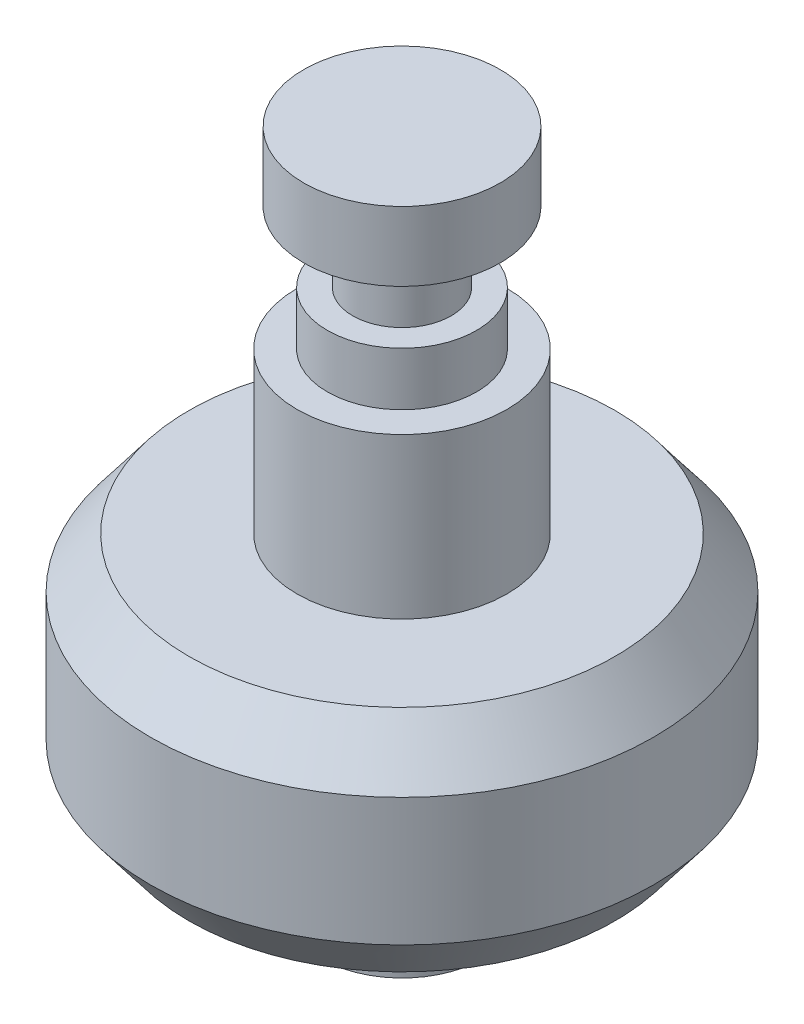
ISO-10303-21;
HEADER;
FILE_DESCRIPTION(('STEP AP214'),'2;1');
FILE_NAME('part.step','',(''),(''),'','','');
FILE_SCHEMA(('AUTOMOTIVE_DESIGN { 1 0 10303 214 1 1 1 1 }'));
ENDSEC;
DATA;
#1=APPLICATION_CONTEXT('core data for automotive mechanical design processes');
#2=APPLICATION_PROTOCOL_DEFINITION('international standard','automotive_design',2000,#1);
#3=PRODUCT_CONTEXT('',#1,'mechanical');
#4=PRODUCT('Part','Part','',(#3));
#5=PRODUCT_RELATED_PRODUCT_CATEGORY('part','',(#4));
#6=PRODUCT_DEFINITION_FORMATION('','',#4);
#7=PRODUCT_DEFINITION_CONTEXT('part definition',#1,'design');
#8=PRODUCT_DEFINITION('design','',#6,#7);
#9=PRODUCT_DEFINITION_SHAPE('','',#8);
#10=(LENGTH_UNIT() NAMED_UNIT(*) SI_UNIT(.MILLI.,.METRE.));
#11=(NAMED_UNIT(*) PLANE_ANGLE_UNIT() SI_UNIT($,.RADIAN.));
#12=(NAMED_UNIT(*) SI_UNIT($,.STERADIAN.) SOLID_ANGLE_UNIT());
#13=UNCERTAINTY_MEASURE_WITH_UNIT(LENGTH_MEASURE(1.E-05),#10,'distance_accuracy_value','');
#14=(GEOMETRIC_REPRESENTATION_CONTEXT(3) GLOBAL_UNCERTAINTY_ASSIGNED_CONTEXT((#13)) GLOBAL_UNIT_ASSIGNED_CONTEXT((#10,
#11,#12)) REPRESENTATION_CONTEXT('',''));
#15=CARTESIAN_POINT('',(0.,0.,0.));
#16=DIRECTION('',(0.,0.,1.));
#17=DIRECTION('',(1.,0.,0.));
#18=AXIS2_PLACEMENT_3D('',#15,#16,#17);
#19=CARTESIAN_POINT('',(0.,0.,0.));
#20=DIRECTION('',(0.,-1.,0.));
#21=DIRECTION('',(0.,0.,-1.));
#22=AXIS2_PLACEMENT_3D('',#19,#20,#21);
#23=PLANE('',#22);
#24=CARTESIAN_POINT('',(0.,0.,0.));
#25=DIRECTION('',(0.,1.,0.));
#26=DIRECTION('',(0.,0.,1.));
#27=AXIS2_PLACEMENT_3D('',#24,#25,#26);
#28=CIRCLE('',#27,4.6863);
#29=CARTESIAN_POINT('',(0.,0.,4.6863));
#30=VERTEX_POINT('',#29);
#31=EDGE_CURVE('E10',#30,#30,#28,.T.);
#32=ORIENTED_EDGE('',*,*,#31,.T.);
#33=EDGE_LOOP('',(#32));
#34=FACE_BOUND('',#33,.T.);
#35=ADVANCED_FACE('F32',(#34),#23,.F.);
#36=CARTESIAN_POINT('',(0.,0.,0.));
#37=DIRECTION('',(0.,1.,0.));
#38=DIRECTION('',(0.,0.,1.));
#39=AXIS2_PLACEMENT_3D('',#36,#37,#38);
#40=CYLINDRICAL_SURFACE('',#39,4.6863);
#41=ORIENTED_EDGE('',*,*,#31,.F.);
#42=EDGE_LOOP('',(#41));
#43=FACE_BOUND('',#42,.T.);
#44=CARTESIAN_POINT('',(0.,-3.302,0.));
#45=DIRECTION('',(0.,1.,0.));
#46=DIRECTION('',(0.,0.,1.));
#47=AXIS2_PLACEMENT_3D('',#44,#45,#46);
#48=CIRCLE('',#47,4.6863);
#49=CARTESIAN_POINT('',(0.,-3.302,4.6863));
#50=VERTEX_POINT('',#49);
#51=EDGE_CURVE('E38',#50,#50,#48,.T.);
#52=ORIENTED_EDGE('',*,*,#51,.T.);
#53=EDGE_LOOP('',(#52));
#54=FACE_BOUND('',#53,.T.);
#55=ADVANCED_FACE('F94',(#43,#54),#40,.T.);
#56=CARTESIAN_POINT('',(0.,-3.302,-2.3495));
#57=DIRECTION('',(0.,1.,0.));
#58=DIRECTION('',(0.,0.,1.));
#59=AXIS2_PLACEMENT_3D('',#56,#57,#58);
#60=PLANE('',#59);
#61=ORIENTED_EDGE('',*,*,#51,.F.);
#62=EDGE_LOOP('',(#61));
#63=FACE_BOUND('',#62,.T.);
#64=CARTESIAN_POINT('',(0.,-3.302,0.));
#65=DIRECTION('',(0.,1.,0.));
#66=DIRECTION('',(0.,0.,1.));
#67=AXIS2_PLACEMENT_3D('',#64,#65,#66);
#68=CIRCLE('',#67,2.3495);
#69=CARTESIAN_POINT('',(0.,-3.302,2.3495));
#70=VERTEX_POINT('',#69);
#71=EDGE_CURVE('E42',#70,#70,#68,.T.);
#72=ORIENTED_EDGE('',*,*,#71,.T.);
#73=EDGE_LOOP('',(#72));
#74=FACE_BOUND('',#73,.T.);
#75=ADVANCED_FACE('F98',(#63,#74),#60,.F.);
#76=CARTESIAN_POINT('',(0.,0.,0.));
#77=DIRECTION('',(0.,1.,0.));
#78=DIRECTION('',(0.,0.,1.));
#79=AXIS2_PLACEMENT_3D('',#76,#77,#78);
#80=CYLINDRICAL_SURFACE('',#79,2.3495);
#81=ORIENTED_EDGE('',*,*,#71,.F.);
#82=EDGE_LOOP('',(#81));
#83=FACE_BOUND('',#82,.T.);
#84=CARTESIAN_POINT('',(0.,-6.6548,0.));
#85=DIRECTION('',(0.,1.,0.));
#86=DIRECTION('',(0.,0.,1.));
#87=AXIS2_PLACEMENT_3D('',#84,#85,#86);
#88=CIRCLE('',#87,2.3495);
#89=CARTESIAN_POINT('',(0.,-6.6548,2.3495));
#90=VERTEX_POINT('',#89);
#91=EDGE_CURVE('E46',#90,#90,#88,.T.);
#92=ORIENTED_EDGE('',*,*,#91,.T.);
#93=EDGE_LOOP('',(#92));
#94=FACE_BOUND('',#93,.T.);
#95=ADVANCED_FACE('F103',(#83,#94),#80,.T.);
#96=CARTESIAN_POINT('',(0.,-6.6548,-2.3495));
#97=DIRECTION('',(0.,-1.,0.));
#98=DIRECTION('',(0.,0.,-1.));
#99=AXIS2_PLACEMENT_3D('',#96,#97,#98);
#100=PLANE('',#99);
#101=ORIENTED_EDGE('',*,*,#91,.F.);
#102=EDGE_LOOP('',(#101));
#103=FACE_BOUND('',#102,.T.);
#104=CARTESIAN_POINT('',(0.,-6.6548,0.));
#105=DIRECTION('',(0.,1.,0.));
#106=DIRECTION('',(0.,0.,1.));
#107=AXIS2_PLACEMENT_3D('',#104,#105,#106);
#108=CIRCLE('',#107,3.556);
#109=CARTESIAN_POINT('',(0.,-6.6548,3.556));
#110=VERTEX_POINT('',#109);
#111=EDGE_CURVE('E51',#110,#110,#108,.T.);
#112=ORIENTED_EDGE('',*,*,#111,.T.);
#113=EDGE_LOOP('',(#112));
#114=FACE_BOUND('',#113,.T.);
#115=ADVANCED_FACE('F109',(#103,#114),#100,.F.);
#116=CARTESIAN_POINT('',(0.,0.,0.));
#117=DIRECTION('',(0.,1.,0.));
#118=DIRECTION('',(0.,0.,1.));
#119=AXIS2_PLACEMENT_3D('',#116,#117,#118);
#120=CYLINDRICAL_SURFACE('',#119,3.556);
#121=ORIENTED_EDGE('',*,*,#111,.F.);
#122=EDGE_LOOP('',(#121));
#123=FACE_BOUND('',#122,.T.);
#124=CARTESIAN_POINT('',(0.,-9.1948,0.));
#125=DIRECTION('',(0.,1.,0.));
#126=DIRECTION('',(0.,0.,1.));
#127=AXIS2_PLACEMENT_3D('',#124,#125,#126);
#128=CIRCLE('',#127,3.556);
#129=CARTESIAN_POINT('',(0.,-9.1948,3.556));
#130=VERTEX_POINT('',#129);
#131=EDGE_CURVE('E54',#130,#130,#128,.T.);
#132=ORIENTED_EDGE('',*,*,#131,.T.);
#133=EDGE_LOOP('',(#132));
#134=FACE_BOUND('',#133,.T.);
#135=ADVANCED_FACE('F113',(#123,#134),#120,.T.);
#136=CARTESIAN_POINT('',(0.,-9.1948,-3.556));
#137=DIRECTION('',(0.,-1.,0.));
#138=DIRECTION('',(0.,0.,-1.));
#139=AXIS2_PLACEMENT_3D('',#136,#137,#138);
#140=PLANE('',#139);
#141=ORIENTED_EDGE('',*,*,#131,.F.);
#142=EDGE_LOOP('',(#141));
#143=FACE_BOUND('',#142,.T.);
#144=CARTESIAN_POINT('',(0.,-9.1948,0.));
#145=DIRECTION('',(0.,1.,0.));
#146=DIRECTION('',(0.,0.,1.));
#147=AXIS2_PLACEMENT_3D('',#144,#145,#146);
#148=CIRCLE('',#147,5.0038);
#149=CARTESIAN_POINT('',(0.,-9.1948,5.0038));
#150=VERTEX_POINT('',#149);
#151=EDGE_CURVE('E57',#150,#150,#148,.T.);
#152=ORIENTED_EDGE('',*,*,#151,.T.);
#153=EDGE_LOOP('',(#152));
#154=FACE_BOUND('',#153,.T.);
#155=ADVANCED_FACE('F117',(#143,#154),#140,.F.);
#156=CARTESIAN_POINT('',(0.,0.,0.));
#157=DIRECTION('',(0.,1.,0.));
#158=DIRECTION('',(0.,0.,1.));
#159=AXIS2_PLACEMENT_3D('',#156,#157,#158);
#160=CYLINDRICAL_SURFACE('',#159,5.0038);
#161=ORIENTED_EDGE('',*,*,#151,.F.);
#162=EDGE_LOOP('',(#161));
#163=FACE_BOUND('',#162,.T.);
#164=CARTESIAN_POINT('',(0.,-16.8148,0.));
#165=DIRECTION('',(0.,1.,0.));
#166=DIRECTION('',(0.,0.,1.));
#167=AXIS2_PLACEMENT_3D('',#164,#165,#166);
#168=CIRCLE('',#167,5.0038);
#169=CARTESIAN_POINT('',(0.,-16.8148,5.0038));
#170=VERTEX_POINT('',#169);
#171=EDGE_CURVE('E60',#170,#170,#168,.T.);
#172=ORIENTED_EDGE('',*,*,#171,.T.);
#173=EDGE_LOOP('',(#172));
#174=FACE_BOUND('',#173,.T.);
#175=ADVANCED_FACE('F121',(#163,#174),#160,.T.);
#176=CARTESIAN_POINT('',(0.,-16.8148,-5.0038));
#177=DIRECTION('',(0.,-1.,0.));
#178=DIRECTION('',(0.,0.,-1.));
#179=AXIS2_PLACEMENT_3D('',#176,#177,#178);
#180=PLANE('',#179);
#181=ORIENTED_EDGE('',*,*,#171,.F.);
#182=EDGE_LOOP('',(#181));
#183=FACE_BOUND('',#182,.T.);
#184=CARTESIAN_POINT('',(0.,-16.8148,0.));
#185=DIRECTION('',(0.,1.,0.));
#186=DIRECTION('',(0.,0.,1.));
#187=AXIS2_PLACEMENT_3D('',#184,#185,#186);
#188=CIRCLE('',#187,10.16);
#189=CARTESIAN_POINT('',(0.,-16.8148,10.16));
#190=VERTEX_POINT('',#189);
#191=EDGE_CURVE('E63',#190,#190,#188,.T.);
#192=ORIENTED_EDGE('',*,*,#191,.T.);
#193=EDGE_LOOP('',(#192));
#194=FACE_BOUND('',#193,.T.);
#195=ADVANCED_FACE('F125',(#183,#194),#180,.F.);
#196=CARTESIAN_POINT('',(0.,-19.2278,0.));
#197=DIRECTION('',(0.,-1.,0.));
#198=DIRECTION('',(0.,0.,-1.));
#199=AXIS2_PLACEMENT_3D('',#196,#197,#198);
#200=CONICAL_SURFACE('',#199,12.0015,0.651869114305576);
#201=ORIENTED_EDGE('',*,*,#191,.F.);
#202=EDGE_LOOP('',(#201));
#203=FACE_BOUND('',#202,.T.);
#204=CARTESIAN_POINT('',(0.,-19.2278,0.));
#205=DIRECTION('',(0.,1.,0.));
#206=DIRECTION('',(0.,0.,1.));
#207=AXIS2_PLACEMENT_3D('',#204,#205,#206);
#208=CIRCLE('',#207,12.0015);
#209=CARTESIAN_POINT('',(0.,-19.2278,12.0015));
#210=VERTEX_POINT('',#209);
#211=EDGE_CURVE('E66',#210,#210,#208,.T.);
#212=ORIENTED_EDGE('',*,*,#211,.T.);
#213=EDGE_LOOP('',(#212));
#214=FACE_BOUND('',#213,.T.);
#215=ADVANCED_FACE('F129',(#203,#214),#200,.T.);
#216=CARTESIAN_POINT('',(0.,0.,0.));
#217=DIRECTION('',(0.,1.,0.));
#218=DIRECTION('',(0.,0.,1.));
#219=AXIS2_PLACEMENT_3D('',#216,#217,#218);
#220=CYLINDRICAL_SURFACE('',#219,12.0015);
#221=ORIENTED_EDGE('',*,*,#211,.F.);
#222=EDGE_LOOP('',(#221));
#223=FACE_BOUND('',#222,.T.);
#224=CARTESIAN_POINT('',(0.,-25.3238,0.));
#225=DIRECTION('',(0.,1.,0.));
#226=DIRECTION('',(0.,0.,1.));
#227=AXIS2_PLACEMENT_3D('',#224,#225,#226);
#228=CIRCLE('',#227,12.0015);
#229=CARTESIAN_POINT('',(0.,-25.3238,12.0015));
#230=VERTEX_POINT('',#229);
#231=EDGE_CURVE('E69',#230,#230,#228,.T.);
#232=ORIENTED_EDGE('',*,*,#231,.T.);
#233=EDGE_LOOP('',(#232));
#234=FACE_BOUND('',#233,.T.);
#235=ADVANCED_FACE('F133',(#223,#234),#220,.T.);
#236=CARTESIAN_POINT('',(0.,-27.7368,0.));
#237=DIRECTION('',(0.,1.,0.));
#238=DIRECTION('',(0.,0.,1.));
#239=AXIS2_PLACEMENT_3D('',#236,#237,#238);
#240=CONICAL_SURFACE('',#239,10.16,0.651869114305576);
#241=ORIENTED_EDGE('',*,*,#231,.F.);
#242=EDGE_LOOP('',(#241));
#243=FACE_BOUND('',#242,.T.);
#244=CARTESIAN_POINT('',(0.,-27.7368,0.));
#245=DIRECTION('',(0.,1.,0.));
#246=DIRECTION('',(0.,0.,1.));
#247=AXIS2_PLACEMENT_3D('',#244,#245,#246);
#248=CIRCLE('',#247,10.16);
#249=CARTESIAN_POINT('',(0.,-27.7368,10.16));
#250=VERTEX_POINT('',#249);
#251=EDGE_CURVE('E72',#250,#250,#248,.T.);
#252=ORIENTED_EDGE('',*,*,#251,.T.);
#253=EDGE_LOOP('',(#252));
#254=FACE_BOUND('',#253,.T.);
#255=ADVANCED_FACE('F137',(#243,#254),#240,.T.);
#256=CARTESIAN_POINT('',(0.,-27.7368,-10.16));
#257=DIRECTION('',(0.,1.,0.));
#258=DIRECTION('',(0.,0.,1.));
#259=AXIS2_PLACEMENT_3D('',#256,#257,#258);
#260=PLANE('',#259);
#261=ORIENTED_EDGE('',*,*,#251,.F.);
#262=EDGE_LOOP('',(#261));
#263=FACE_BOUND('',#262,.T.);
#264=CARTESIAN_POINT('',(0.,-27.7368,0.));
#265=DIRECTION('',(0.,1.,0.));
#266=DIRECTION('',(0.,0.,1.));
#267=AXIS2_PLACEMENT_3D('',#264,#265,#266);
#268=CIRCLE('',#267,3.8735);
#269=CARTESIAN_POINT('',(0.,-27.7368,3.8735));
#270=VERTEX_POINT('',#269);
#271=EDGE_CURVE('E75',#270,#270,#268,.T.);
#272=ORIENTED_EDGE('',*,*,#271,.T.);
#273=EDGE_LOOP('',(#272));
#274=FACE_BOUND('',#273,.T.);
#275=ADVANCED_FACE('F90',(#263,#274),#260,.F.);
#276=CARTESIAN_POINT('',(0.,0.,0.));
#277=DIRECTION('',(0.,1.,0.));
#278=DIRECTION('',(0.,0.,1.));
#279=AXIS2_PLACEMENT_3D('',#276,#277,#278);
#280=CYLINDRICAL_SURFACE('',#279,3.8735);
#281=ORIENTED_EDGE('',*,*,#271,.F.);
#282=EDGE_LOOP('',(#281));
#283=FACE_BOUND('',#282,.T.);
#284=CARTESIAN_POINT('',(0.,-32.4358,0.));
#285=DIRECTION('',(0.,1.,0.));
#286=DIRECTION('',(0.,0.,1.));
#287=AXIS2_PLACEMENT_3D('',#284,#285,#286);
#288=CIRCLE('',#287,3.8735);
#289=CARTESIAN_POINT('',(0.,-32.4358,3.8735));
#290=VERTEX_POINT('',#289);
#291=EDGE_CURVE('E78',#290,#290,#288,.T.);
#292=ORIENTED_EDGE('',*,*,#291,.T.);
#293=EDGE_LOOP('',(#292));
#294=FACE_BOUND('',#293,.T.);
#295=ADVANCED_FACE('F82',(#283,#294),#280,.T.);
#296=CARTESIAN_POINT('',(0.,-32.4358,-3.8735));
#297=DIRECTION('',(0.,1.,0.));
#298=DIRECTION('',(0.,0.,1.));
#299=AXIS2_PLACEMENT_3D('',#296,#297,#298);
#300=PLANE('',#299);
#301=ORIENTED_EDGE('',*,*,#291,.F.);
#302=EDGE_LOOP('',(#301));
#303=FACE_BOUND('',#302,.T.);
#304=ADVANCED_FACE('F84',(#303),#300,.F.);
#305=CLOSED_SHELL('',(#35,#55,#75,#95,#115,#135,#155,#175,#195,#215,#235,#255,#275,#295,#304));
#306=MANIFOLD_SOLID_BREP('B2',#305);
#307=ADVANCED_BREP_SHAPE_REPRESENTATION('',(#18,#306),#14);
#308=SHAPE_DEFINITION_REPRESENTATION(#9,#307);
ENDSEC;
END-ISO-10303-21;
